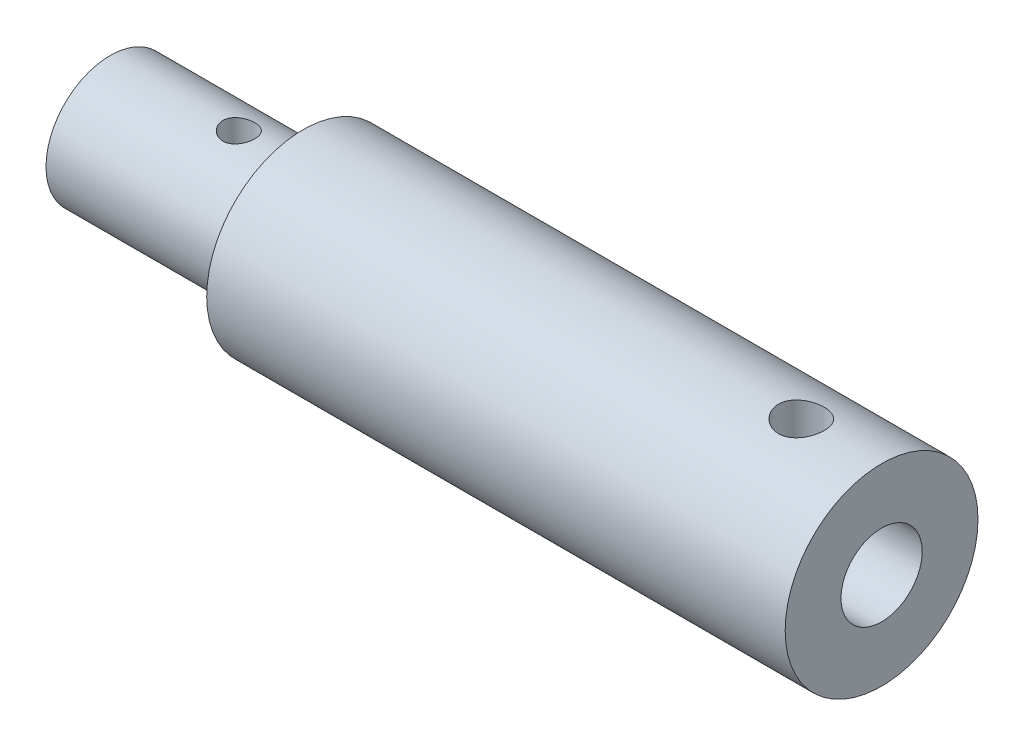
ISO-10303-21;
HEADER;
FILE_DESCRIPTION(('STEP AP214'),'2;1');
FILE_NAME('part.step','',(''),(''),'','','');
FILE_SCHEMA(('AUTOMOTIVE_DESIGN { 1 0 10303 214 1 1 1 1 }'));
ENDSEC;
DATA;
#1=APPLICATION_CONTEXT('core data for automotive mechanical design processes');
#2=APPLICATION_PROTOCOL_DEFINITION('international standard','automotive_design',2000,#1);
#3=PRODUCT_CONTEXT('',#1,'mechanical');
#4=PRODUCT('Part','Part','',(#3));
#5=PRODUCT_RELATED_PRODUCT_CATEGORY('part','',(#4));
#6=PRODUCT_DEFINITION_FORMATION('','',#4);
#7=PRODUCT_DEFINITION_CONTEXT('part definition',#1,'design');
#8=PRODUCT_DEFINITION('design','',#6,#7);
#9=PRODUCT_DEFINITION_SHAPE('','',#8);
#10=(LENGTH_UNIT() NAMED_UNIT(*) SI_UNIT(.MILLI.,.METRE.));
#11=(NAMED_UNIT(*) PLANE_ANGLE_UNIT() SI_UNIT($,.RADIAN.));
#12=(NAMED_UNIT(*) SI_UNIT($,.STERADIAN.) SOLID_ANGLE_UNIT());
#13=UNCERTAINTY_MEASURE_WITH_UNIT(LENGTH_MEASURE(1.E-05),#10,'distance_accuracy_value','');
#14=(GEOMETRIC_REPRESENTATION_CONTEXT(3) GLOBAL_UNCERTAINTY_ASSIGNED_CONTEXT((#13)) GLOBAL_UNIT_ASSIGNED_CONTEXT((#10,
#11,#12)) REPRESENTATION_CONTEXT('',''));
#15=CARTESIAN_POINT('',(0.,0.,0.));
#16=DIRECTION('',(0.,0.,1.));
#17=DIRECTION('',(1.,0.,0.));
#18=AXIS2_PLACEMENT_3D('',#15,#16,#17);
#19=CARTESIAN_POINT('',(38.1,0.,0.));
#20=DIRECTION('',(-1.,0.,0.));
#21=DIRECTION('',(0.,0.,1.));
#22=AXIS2_PLACEMENT_3D('',#19,#20,#21);
#23=CYLINDRICAL_SURFACE('',#22,4.7625);
#24=CARTESIAN_POINT('',(34.1376,4.62642714845916,-1.1303));
#25=CARTESIAN_POINT('',(34.0750775259716,4.62642838901824,-1.13029805423627));
#26=CARTESIAN_POINT('',(34.0125327757224,4.62770838699482,-1.12509469807993));
#27=CARTESIAN_POINT('',(33.889232022083,4.6326785638604,-1.10444752292998));
#28=CARTESIAN_POINT('',(33.8284771909426,4.63637028710392,-1.08899714213105));
#29=CARTESIAN_POINT('',(33.7105575827576,4.64572278948456,-1.04837814678197));
#30=CARTESIAN_POINT('',(33.6533885619544,4.65138118712488,-1.02322128202526));
#31=CARTESIAN_POINT('',(33.5440782330937,4.66402656033619,-0.96393837411517));
#32=CARTESIAN_POINT('',(33.4919370072882,4.67101355763679,-0.92981218426262));
#33=CARTESIAN_POINT('',(33.3931270444802,4.68568402813969,-0.852836301919557));
#34=CARTESIAN_POINT('',(33.3465727707916,4.69337771733691,-0.80984159842551));
#35=CARTESIAN_POINT('',(33.2612641255741,4.70850573012954,-0.716661805014784));
#36=CARTESIAN_POINT('',(33.2225104296223,4.71594003121431,-0.666476092957028));
#37=CARTESIAN_POINT('',(33.1534411997972,4.72982392662853,-0.559561665599791));
#38=CARTESIAN_POINT('',(33.1232371319024,4.7362600587655,-0.502759041559995));
#39=CARTESIAN_POINT('',(33.0728477682259,4.74730637166582,-0.384705189759932));
#40=CARTESIAN_POINT('',(33.052661144161,4.75191679449644,-0.323454553028317));
#41=CARTESIAN_POINT('',(33.0232435558391,4.75872001042334,-0.199435431201459));
#42=CARTESIAN_POINT('',(33.0138184738088,4.76095558789368,-0.136715378385379));
#43=CARTESIAN_POINT('',(33.0055831971712,4.76290595779978,-0.0105471731538529));
#44=CARTESIAN_POINT('',(33.0067715822857,4.7626210875181,0.0529008807067487));
#45=CARTESIAN_POINT('',(33.0195878043426,4.75959486535025,0.177381143927695));
#46=CARTESIAN_POINT('',(33.0310062398402,4.75690278929689,0.238436289350237));
#47=CARTESIAN_POINT('',(33.0636230697014,4.74942148334886,0.357738034135677));
#48=CARTESIAN_POINT('',(33.084821954153,4.74463214836336,0.415984492596646));
#49=CARTESIAN_POINT('',(33.136573912979,4.73341744305927,0.528579543133831));
#50=CARTESIAN_POINT('',(33.1672035332136,4.72697876022154,0.582891572165086));
#51=CARTESIAN_POINT('',(33.2368898743976,4.7131670289965,0.685679466576254));
#52=CARTESIAN_POINT('',(33.2759479300973,4.70579383269348,0.734154405681964));
#53=CARTESIAN_POINT('',(33.3625124952201,4.69070701664461,0.825139727879791));
#54=CARTESIAN_POINT('',(33.4102021517143,4.68298948105039,0.867475386599055));
#55=CARTESIAN_POINT('',(33.512084880592,4.66825033727962,0.94358476200142));
#56=CARTESIAN_POINT('',(33.5662781985238,4.66122875539735,0.977358155263043));
#57=CARTESIAN_POINT('',(33.6799470965797,4.64866391717303,1.03548149898305));
#58=CARTESIAN_POINT('',(33.7394429361595,4.64312668568723,1.05979322029418));
#59=CARTESIAN_POINT('',(33.8618394839337,4.6342370321862,1.09801758146264));
#60=CARTESIAN_POINT('',(33.9247395417684,4.63088419443757,1.11193220016862));
#61=CARTESIAN_POINT('',(34.0505486305075,4.62682920681551,1.12868548039284));
#62=CARTESIAN_POINT('',(34.1134215409437,4.6260656397816,1.13178082925175));
#63=CARTESIAN_POINT('',(34.2387852257098,4.62710909642491,1.12750718204534));
#64=CARTESIAN_POINT('',(34.3012760309748,4.62891590916261,1.12013904467148));
#65=CARTESIAN_POINT('',(34.4231736827724,4.6348380433821,1.09537169422541));
#66=CARTESIAN_POINT('',(34.4826119865441,4.63891973604529,1.07811850697576));
#67=CARTESIAN_POINT('',(34.5977535080337,4.64890046664806,1.0342311057962));
#68=CARTESIAN_POINT('',(34.6534563170258,4.6547997030637,1.00759586729929));
#69=CARTESIAN_POINT('',(34.7606430296264,4.66788249324334,0.945151389946627));
#70=CARTESIAN_POINT('',(34.8120337592089,4.67508711291606,0.909186724966108));
#71=CARTESIAN_POINT('',(34.9081449640821,4.68991561801779,0.829303668896757));
#72=CARTESIAN_POINT('',(34.9528644544695,4.69753956512693,0.785384105507542));
#73=CARTESIAN_POINT('',(35.0353852160885,4.71255346581324,0.689666770395239));
#74=CARTESIAN_POINT('',(35.0730099797708,4.71993441049171,0.637715160229859));
#75=CARTESIAN_POINT('',(35.138999685825,4.73345357065448,0.528080996625005));
#76=CARTESIAN_POINT('',(35.1673650949585,4.73959184877535,0.470398732257505));
#77=CARTESIAN_POINT('',(35.2137977943514,4.74989666973638,0.351326818689582));
#78=CARTESIAN_POINT('',(35.2319360521981,4.75407676549875,0.289966071089918));
#79=CARTESIAN_POINT('',(35.2576166732252,4.76005328584338,0.164956304659748));
#80=CARTESIAN_POINT('',(35.2651608670675,4.76185012225163,0.101307683125544));
#81=CARTESIAN_POINT('',(35.2693448257628,4.76284277619185,-0.0248058123466566));
#82=CARTESIAN_POINT('',(35.2662463021068,4.76210102100744,-0.0872616512535958));
#83=CARTESIAN_POINT('',(35.2498263168143,4.75823630150041,-0.210735438966009));
#84=CARTESIAN_POINT('',(35.2365051060361,4.75511339560976,-0.271753423017671));
#85=CARTESIAN_POINT('',(35.200152265988,4.74684485428859,-0.390375307573605));
#86=CARTESIAN_POINT('',(35.1771637211855,4.74170820034098,-0.44799307821931));
#87=CARTESIAN_POINT('',(35.1221687352297,4.72995611183917,-0.558585363410868));
#88=CARTESIAN_POINT('',(35.0901612606168,4.72334050783327,-0.611559344922467));
#89=CARTESIAN_POINT('',(35.0172156117081,4.70916627810365,-0.712616660322824));
#90=CARTESIAN_POINT('',(34.9760970787535,4.70159016205745,-0.760567360093438));
#91=CARTESIAN_POINT('',(34.8864524871105,4.68643366014744,-0.848977207813521));
#92=CARTESIAN_POINT('',(34.837924596891,4.67885327369088,-0.88943449796752));
#93=CARTESIAN_POINT('',(34.7338828135499,4.66440648065221,-0.96235454223778));
#94=CARTESIAN_POINT('',(34.6782675833458,4.65755378982527,-0.99467561772967));
#95=CARTESIAN_POINT('',(34.562240168282,4.64551729998629,-1.04946070676233));
#96=CARTESIAN_POINT('',(34.5018317610909,4.64033220265826,-1.07193239358025));
#97=CARTESIAN_POINT('',(34.3908121579242,4.63309160945185,-1.10275167928248));
#98=CARTESIAN_POINT('',(34.3407641625617,4.63061028274686,-1.11306095578954));
#99=CARTESIAN_POINT('',(34.2396823499598,4.62727760135537,-1.12683567723709));
#100=CARTESIAN_POINT('',(34.1886486001582,4.62642613556252,-1.13030158868497));
#101=CARTESIAN_POINT('',(34.1376,4.62642714845916,-1.1303));
#102=B_SPLINE_CURVE_WITH_KNOTS('',3,(#24,#25,#26,#27,#28,#29,#30,#31,#32,#33,#34,#35,#36,#37,
#38,#39,#40,#41,#42,#43,#44,#45,#46,#47,#48,#49,#50,#51,#52,#53,#54,#55,#56,#57,#58,#59,#60,#61,
#62,#63,#64,#65,#66,#67,#68,#69,#70,#71,#72,#73,#74,#75,#76,#77,#78,#79,#80,#81,#82,#83,#84,#85,
#86,#87,#88,#89,#90,#91,#92,#93,#94,#95,#96,#97,#98,#99,#100,#101),.UNSPECIFIED.,.T.,.F.,(4,2,2,
2,2,2,2,2,2,2,2,2,2,2,2,2,2,2,2,2,2,2,2,2,2,2,2,2,2,2,2,2,2,2,2,2,2,2,4),(0.,0.187380121042666,
0.374880349201824,0.562154315010259,0.749431343997326,0.940055506735482,1.13069617158294,
1.32371850082295,1.51671522902965,1.70617275891672,1.89560493626407,2.08124599438499,
2.26689635579561,2.45409517358991,2.64132365848947,2.83312791507994,3.02493941559165,
3.21751806320303,3.41006004856844,3.59800175755483,3.78592804389812,3.97114726568215,
4.15638672060751,4.34493623230582,4.53351355287892,4.72629599338789,4.91906871428536,
5.11048675596524,5.30187171639601,5.48858443275623,5.6752925674496,5.86117727273005,
6.0470832868009,6.2370637896613,6.42709133036918,6.62022893778867,6.81321581056895,
6.96621911322517,7.11921198539391),.UNSPECIFIED.);
#103=CARTESIAN_POINT('',(34.1376,4.62642714845916,-1.1303));
#104=VERTEX_POINT('',#103);
#105=EDGE_CURVE('E60',#104,#104,#102,.T.);
#106=ORIENTED_EDGE('',*,*,#105,.F.);
#107=EDGE_LOOP('',(#106));
#108=FACE_BOUND('',#107,.T.);
#109=CARTESIAN_POINT('',(38.1,0.,0.));
#110=DIRECTION('',(1.,0.,0.));
#111=DIRECTION('',(0.,0.,-1.));
#112=AXIS2_PLACEMENT_3D('',#109,#110,#111);
#113=CIRCLE('',#112,4.7625);
#114=CARTESIAN_POINT('',(38.1,0.,-4.7625));
#115=VERTEX_POINT('',#114);
#116=EDGE_CURVE('E10',#115,#115,#113,.T.);
#117=ORIENTED_EDGE('',*,*,#116,.F.);
#118=EDGE_LOOP('',(#117));
#119=FACE_BOUND('',#118,.T.);
#120=CARTESIAN_POINT('',(9.525,0.,0.));
#121=DIRECTION('',(-1.,0.,0.));
#122=DIRECTION('',(0.,0.,1.));
#123=AXIS2_PLACEMENT_3D('',#120,#121,#122);
#124=CIRCLE('',#123,4.7625);
#125=CARTESIAN_POINT('',(9.525,0.,4.7625));
#126=VERTEX_POINT('',#125);
#127=EDGE_CURVE('E61',#126,#126,#124,.T.);
#128=ORIENTED_EDGE('',*,*,#127,.F.);
#129=EDGE_LOOP('',(#128));
#130=FACE_BOUND('',#129,.T.);
#131=ADVANCED_FACE('F32',(#108,#119,#130),#23,.T.);
#132=CARTESIAN_POINT('',(30.1752,0.,0.));
#133=DIRECTION('',(1.,0.,0.));
#134=DIRECTION('',(0.,0.,-1.));
#135=AXIS2_PLACEMENT_3D('',#132,#133,#134);
#136=CYLINDRICAL_SURFACE('',#135,2.0066);
#137=CARTESIAN_POINT('',(38.1,0.,0.));
#138=DIRECTION('',(1.,0.,0.));
#139=DIRECTION('',(0.,0.,-1.));
#140=AXIS2_PLACEMENT_3D('',#137,#138,#139);
#141=CIRCLE('',#140,2.0066);
#142=CARTESIAN_POINT('',(38.1,0.,-2.0066));
#143=VERTEX_POINT('',#142);
#144=EDGE_CURVE('E49',#143,#143,#141,.T.);
#145=ORIENTED_EDGE('',*,*,#144,.T.);
#146=EDGE_LOOP('',(#145));
#147=FACE_BOUND('',#146,.T.);
#148=CARTESIAN_POINT('',(30.1752,0.,0.));
#149=DIRECTION('',(1.,0.,0.));
#150=DIRECTION('',(0.,0.,-1.));
#151=AXIS2_PLACEMENT_3D('',#148,#149,#150);
#152=CIRCLE('',#151,2.0066);
#153=CARTESIAN_POINT('',(30.1752,0.,-2.0066));
#154=VERTEX_POINT('',#153);
#155=EDGE_CURVE('E44',#154,#154,#152,.T.);
#156=ORIENTED_EDGE('',*,*,#155,.F.);
#157=EDGE_LOOP('',(#156));
#158=FACE_BOUND('',#157,.T.);
#159=CARTESIAN_POINT('',(34.1376,1.65797028622349,-1.1303));
#160=CARTESIAN_POINT('',(34.195251209096,1.65797637198512,-1.13029575818968));
#161=CARTESIAN_POINT('',(34.2529460500531,1.6610253484613,-1.12585828294536));
#162=CARTESIAN_POINT('',(34.3664640189629,1.67273264944485,-1.10838248876552));
#163=CARTESIAN_POINT('',(34.4222840246714,1.68139988609383,-1.09533050419437));
#164=CARTESIAN_POINT('',(34.530177119279,1.70299732881238,-1.06143323018493));
#165=CARTESIAN_POINT('',(34.5822720396219,1.7158996982644,-1.04063871395273));
#166=CARTESIAN_POINT('',(34.6822106018923,1.744467628616,-0.992002970624394));
#167=CARTESIAN_POINT('',(34.7300532218785,1.76013385105757,-0.96416005576344));
#168=CARTESIAN_POINT('',(34.8257287413124,1.79448726439518,-0.898756055590558));
#169=CARTESIAN_POINT('',(34.873018621699,1.81331851857658,-0.8604760313723));
#170=CARTESIAN_POINT('',(34.960946743248,1.85072451409441,-0.776766436810111));
#171=CARTESIAN_POINT('',(35.001580781707,1.86929908662915,-0.731332384427762));
#172=CARTESIAN_POINT('',(35.078703338456,1.90611899100281,-0.629554883377022));
#173=CARTESIAN_POINT('',(35.1144739746953,1.92417921142352,-0.572593976802609));
#174=CARTESIAN_POINT('',(35.175670785692,1.95595793429568,-0.452252347783182));
#175=CARTESIAN_POINT('',(35.2011052285507,1.9696799050299,-0.388876807408993));
#176=CARTESIAN_POINT('',(35.2385841456561,1.99017791322298,-0.263298922756158));
#177=CARTESIAN_POINT('',(35.2515958143849,1.99745173094696,-0.20146849318662));
#178=CARTESIAN_POINT('',(35.2670970835921,2.00613694274782,-0.0761139088710537));
#179=CARTESIAN_POINT('',(35.2695951448153,2.0075530507558,-0.0125911574556196));
#180=CARTESIAN_POINT('',(35.264249179399,2.0045455488276,0.106850205033366));
#181=CARTESIAN_POINT('',(35.2575095057508,2.00074545106449,0.162838624304153));
#182=CARTESIAN_POINT('',(35.2359304080036,1.98874702230872,0.272734613055332));
#183=CARTESIAN_POINT('',(35.2210903561887,1.98054835046188,0.326642020926973));
#184=CARTESIAN_POINT('',(35.183764753,1.96037701770621,0.43156758944857));
#185=CARTESIAN_POINT('',(35.1612068992025,1.94836874781511,0.482552899430881));
#186=CARTESIAN_POINT('',(35.1092549550227,1.92158367402541,0.580105321753611));
#187=CARTESIAN_POINT('',(35.0798587746444,1.90680602399083,0.626671077208092));
#188=CARTESIAN_POINT('',(35.0113534431108,1.87384893860437,0.719601195939145));
#189=CARTESIAN_POINT('',(34.9715279027535,1.85547396405178,0.765368010966156));
#190=CARTESIAN_POINT('',(34.8851637262768,1.81829489840694,0.849932765249481));
#191=CARTESIAN_POINT('',(34.8386177300013,1.79949035611598,0.888722957819215));
#192=CARTESIAN_POINT('',(34.7348351650225,1.76153523627191,0.961921435377068));
#193=CARTESIAN_POINT('',(34.6770032870042,1.74252111781037,0.995564736747795));
#194=CARTESIAN_POINT('',(34.555279012948,1.7087784001161,1.05243571686152));
#195=CARTESIAN_POINT('',(34.4913937367897,1.69404484714625,1.07567545224779));
#196=CARTESIAN_POINT('',(34.3645675029055,1.67236518692917,1.10905776708861));
#197=CARTESIAN_POINT('',(34.3019578934537,1.66489153536032,1.12009738714326));
#198=CARTESIAN_POINT('',(34.1753645838291,1.6572034845318,1.13144850319233));
#199=CARTESIAN_POINT('',(34.1113827906175,1.65697959102847,1.13177403031368));
#200=CARTESIAN_POINT('',(33.9946236269409,1.66326124789685,1.12250636240805));
#201=CARTESIAN_POINT('',(33.9416555800528,1.66872233766816,1.11445273704982));
#202=CARTESIAN_POINT('',(33.8379846921949,1.6840438818777,1.09116121762532));
#203=CARTESIAN_POINT('',(33.7872829611183,1.69390646646436,1.07591984477232));
#204=CARTESIAN_POINT('',(33.6872040249903,1.7173395027059,1.03812264126762));
#205=CARTESIAN_POINT('',(33.6379599395371,1.73104195374579,1.01529973584392));
#206=CARTESIAN_POINT('',(33.5437052812119,1.76055942539692,0.963208300403958));
#207=CARTESIAN_POINT('',(33.4986967431823,1.77637545267181,0.933936694636104));
#208=CARTESIAN_POINT('',(33.40627152822,1.81151423791696,0.864078193507188));
#209=CARTESIAN_POINT('',(33.3597175367299,1.8309801706988,0.822416850455623));
#210=CARTESIAN_POINT('',(33.273896521323,1.86905581433525,0.731773600336805));
#211=CARTESIAN_POINT('',(33.2346343288531,1.88766495139167,0.682786878095547));
#212=CARTESIAN_POINT('',(33.1623500564127,1.92326046309013,0.57523996356544));
#213=CARTESIAN_POINT('',(33.1298273531428,1.94008823325962,0.516287380473032));
#214=CARTESIAN_POINT('',(33.0755065509982,1.9688512061512,0.392539738067625));
#215=CARTESIAN_POINT('',(33.0536969104736,1.9807916718561,0.32775105571676));
#216=CARTESIAN_POINT('',(33.0236957967992,1.99737580942607,0.201404578813098));
#217=CARTESIAN_POINT('',(33.0143251982543,2.0026485261898,0.140210094316744));
#218=CARTESIAN_POINT('',(33.0057409612112,2.00747497830063,0.0169004675144971));
#219=CARTESIAN_POINT('',(33.0065213636172,2.00703206897949,-0.0452141132610421));
#220=CARTESIAN_POINT('',(33.0176092222191,2.00080706438243,-0.162229491830126));
#221=CARTESIAN_POINT('',(33.0269931836723,1.99554256873961,-0.217249532446759));
#222=CARTESIAN_POINT('',(33.0535528496194,1.98088395688254,-0.324789512871052));
#223=CARTESIAN_POINT('',(33.0707294418231,1.97148937018629,-0.377309167089932));
#224=CARTESIAN_POINT('',(33.1128411583277,1.94901763234977,-0.480246548826341));
#225=CARTESIAN_POINT('',(33.1379994403406,1.93583574364216,-0.530549324639033));
#226=CARTESIAN_POINT('',(33.1950746214801,1.90699069543875,-0.626368651197412));
#227=CARTESIAN_POINT('',(33.2269940805527,1.89132659668533,-0.671883379275195));
#228=CARTESIAN_POINT('',(33.3009996521795,1.85676328904105,-0.76255918797544));
#229=CARTESIAN_POINT('',(33.3438417254275,1.83770057584232,-0.807041650274417));
#230=CARTESIAN_POINT('',(33.4362666220146,1.7997107194572,-0.888544773205655));
#231=CARTESIAN_POINT('',(33.485858101351,1.78078378376282,-0.925555697837137));
#232=CARTESIAN_POINT('',(33.5950385239224,1.74367470592001,-0.993812600678885));
#233=CARTESIAN_POINT('',(33.6551027141693,1.72566131401167,-1.02439779980572));
#234=CARTESIAN_POINT('',(33.7808025036503,1.694847031231,-1.07462502182381));
#235=CARTESIAN_POINT('',(33.8464201781428,1.68203008936981,-1.09430081239785));
#236=CARTESIAN_POINT('',(33.9503399786615,1.66811353993528,-1.11530910819667));
#237=CARTESIAN_POINT('',(33.9874624722939,1.66433594009497,-1.12091473749271));
#238=CARTESIAN_POINT('',(34.0622504686519,1.65926245642189,-1.12841137188855));
#239=CARTESIAN_POINT('',(34.099915913103,1.65796630822591,-1.13030277268684));
#240=CARTESIAN_POINT('',(34.1376,1.65797028622349,-1.1303));
#241=B_SPLINE_CURVE_WITH_KNOTS('',3,(#159,#160,#161,#162,#163,#164,#165,#166,#167,#168,#169,
#170,#171,#172,#173,#174,#175,#176,#177,#178,#179,#180,#181,#182,#183,#184,#185,#186,#187,#188,
#189,#190,#191,#192,#193,#194,#195,#196,#197,#198,#199,#200,#201,#202,#203,#204,#205,#206,#207,
#208,#209,#210,#211,#212,#213,#214,#215,#216,#217,#218,#219,#220,#221,#222,#223,#224,#225,#226,
#227,#228,#229,#230,#231,#232,#233,#234,#235,#236,#237,#238,#239,#240),.UNSPECIFIED.,.T.,.F.,(4,
2,2,2,2,2,2,2,2,2,2,2,2,2,2,2,2,2,2,2,2,2,2,2,2,2,2,2,2,2,2,2,2,2,2,2,2,2,2,2,4),(0.,
0.172793012733998,0.345860796795422,0.517813089371488,0.689806595564021,0.880106292646278,
1.07052569142837,1.27834162951453,1.48599100323516,1.67569558578719,1.86524747580936,
2.03400769409389,2.20278099182944,2.37318077999772,2.54363271599297,2.73302836796344,
2.92263303950349,3.13022789629359,3.33758154560347,3.52839104344624,3.71895064808977,
3.87977963433922,4.0406865399702,4.20800023838707,4.37539391165049,4.57086929359125,
4.76647373635161,4.9735204085456,5.18034352840844,5.36568597777933,5.55091962767822,
5.71833820331424,5.88577585548932,6.05838281740344,6.23105524970179,6.42415185315242,
6.6174984751499,6.82568958982216,7.03323264487312,7.14619195368787,7.25913922763363),.UNSPECIFIED.);
#242=CARTESIAN_POINT('',(34.1376,1.65797028622349,-1.1303));
#243=VERTEX_POINT('',#242);
#244=EDGE_CURVE('E53',#243,#243,#241,.T.);
#245=ORIENTED_EDGE('',*,*,#244,.F.);
#246=EDGE_LOOP('',(#245));
#247=FACE_BOUND('',#246,.T.);
#248=ADVANCED_FACE('F62',(#147,#158,#247),#136,.F.);
#249=CARTESIAN_POINT('',(38.1,0.,0.));
#250=DIRECTION('',(1.,0.,0.));
#251=DIRECTION('',(0.,0.,-1.));
#252=AXIS2_PLACEMENT_3D('',#249,#250,#251);
#253=PLANE('',#252);
#254=ORIENTED_EDGE('',*,*,#144,.F.);
#255=EDGE_LOOP('',(#254));
#256=FACE_BOUND('',#255,.T.);
#257=ORIENTED_EDGE('',*,*,#116,.T.);
#258=EDGE_LOOP('',(#257));
#259=FACE_BOUND('',#258,.T.);
#260=ADVANCED_FACE('F95',(#256,#259),#253,.T.);
#261=CARTESIAN_POINT('',(30.1752,0.,0.));
#262=DIRECTION('',(1.,0.,0.));
#263=DIRECTION('',(0.,0.,-1.));
#264=AXIS2_PLACEMENT_3D('',#261,#262,#263);
#265=PLANE('',#264);
#266=ORIENTED_EDGE('',*,*,#155,.T.);
#267=EDGE_LOOP('',(#266));
#268=FACE_BOUND('',#267,.T.);
#269=ADVANCED_FACE('F71',(#268),#265,.T.);
#270=CARTESIAN_POINT('',(34.1376,8.6868,0.));
#271=DIRECTION('',(0.,-1.,0.));
#272=DIRECTION('',(0.,0.,-1.));
#273=AXIS2_PLACEMENT_3D('',#270,#271,#272);
#274=CYLINDRICAL_SURFACE('',#273,1.1303);
#275=ORIENTED_EDGE('',*,*,#244,.T.);
#276=EDGE_LOOP('',(#275));
#277=FACE_BOUND('',#276,.T.);
#278=ORIENTED_EDGE('',*,*,#105,.T.);
#279=EDGE_LOOP('',(#278));
#280=FACE_BOUND('',#279,.T.);
#281=ADVANCED_FACE('F66',(#277,#280),#274,.F.);
#282=CARTESIAN_POINT('',(9.525,0.,0.));
#283=DIRECTION('',(-1.,0.,0.));
#284=DIRECTION('',(0.,0.,1.));
#285=AXIS2_PLACEMENT_3D('',#282,#283,#284);
#286=PLANE('',#285);
#287=CARTESIAN_POINT('',(9.525,0.,0.));
#288=DIRECTION('',(-1.,0.,0.));
#289=DIRECTION('',(0.,0.,1.));
#290=AXIS2_PLACEMENT_3D('',#287,#288,#289);
#291=CIRCLE('',#290,3.175);
#292=CARTESIAN_POINT('',(9.525,0.,3.175));
#293=VERTEX_POINT('',#292);
#294=EDGE_CURVE('E82',#293,#293,#291,.T.);
#295=ORIENTED_EDGE('',*,*,#294,.F.);
#296=EDGE_LOOP('',(#295));
#297=FACE_BOUND('',#296,.T.);
#298=ORIENTED_EDGE('',*,*,#127,.T.);
#299=EDGE_LOOP('',(#298));
#300=FACE_BOUND('',#299,.T.);
#301=ADVANCED_FACE('F70',(#297,#300),#286,.T.);
#302=CARTESIAN_POINT('',(9.525,0.,0.));
#303=DIRECTION('',(-1.,0.,0.));
#304=DIRECTION('',(0.,0.,1.));
#305=AXIS2_PLACEMENT_3D('',#302,#303,#304);
#306=CYLINDRICAL_SURFACE('',#305,3.175);
#307=CARTESIAN_POINT('',(6.35,-3.07581310225443,0.7874));
#308=CARTESIAN_POINT('',(6.3065075021694,-3.075813939192,0.787398744653916));
#309=CARTESIAN_POINT('',(6.26300103699984,-3.07674566145374,0.783784226445852));
#310=CARTESIAN_POINT('',(6.17723664816889,-3.0803625423924,0.769444212040904));
#311=CARTESIAN_POINT('',(6.13497947835965,-3.08304873806023,0.758714510319309));
#312=CARTESIAN_POINT('',(6.05296662188354,-3.08985205147743,0.730512083187864));
#313=CARTESIAN_POINT('',(6.01320781427514,-3.09396734028734,0.713047973268173));
#314=CARTESIAN_POINT('',(5.93718029137026,-3.10316287879354,0.671898613390606));
#315=CARTESIAN_POINT('',(5.9009117097853,-3.10824316543701,0.648213125219556));
#316=CARTESIAN_POINT('',(5.83210863740529,-3.11891943941669,0.594745480228861));
#317=CARTESIAN_POINT('',(5.79966087582295,-3.12452355873939,0.564853320914091));
#318=CARTESIAN_POINT('',(5.74018427843339,-3.13554546853052,0.500057836854159));
#319=CARTESIAN_POINT('',(5.71315594309829,-3.14096324175205,0.465154049806475));
#320=CARTESIAN_POINT('',(5.66493138615076,-3.15109190098523,0.390732789039579));
#321=CARTESIAN_POINT('',(5.64382024601062,-3.15579207165152,0.351158598507652));
#322=CARTESIAN_POINT('',(5.60858236631455,-3.16386323206305,0.268887241267554));
#323=CARTESIAN_POINT('',(5.5944546131789,-3.1672344146853,0.22619052880039));
#324=CARTESIAN_POINT('',(5.57386200190988,-3.17221027199584,0.139790139759614));
#325=CARTESIAN_POINT('',(5.56724989496921,-3.17384884607327,0.0961235443472484));
#326=CARTESIAN_POINT('',(5.56141418710287,-3.17529294846481,0.00827220844257288));
#327=CARTESIAN_POINT('',(5.56218951053071,-3.17509874364066,-0.0359124556806589));
#328=CARTESIAN_POINT('',(5.57100049547967,-3.17292445001065,-0.122524852571927));
#329=CARTESIAN_POINT('',(5.57887723188311,-3.1709834549647,-0.164969881520884));
#330=CARTESIAN_POINT('',(5.60141214765311,-3.16557912503432,-0.247915901823041));
#331=CARTESIAN_POINT('',(5.61607068475941,-3.16211570984276,-0.288416790498507));
#332=CARTESIAN_POINT('',(5.65188248465348,-3.15399567959344,-0.366745072334393));
#333=CARTESIAN_POINT('',(5.67309255235268,-3.14932868981507,-0.404545374544142));
#334=CARTESIAN_POINT('',(5.72136229878054,-3.13930813357491,-0.476106034644211));
#335=CARTESIAN_POINT('',(5.74842298068023,-3.13395444943371,-0.509865698165378));
#336=CARTESIAN_POINT('',(5.80847867569626,-3.12297597059372,-0.573334431368741));
#337=CARTESIAN_POINT('',(5.84161258434032,-3.11734775299395,-0.602911621812153));
#338=CARTESIAN_POINT('',(5.91242902507928,-3.10658526700961,-0.656118863638047));
#339=CARTESIAN_POINT('',(5.95011176276347,-3.10145102096949,-0.679748646071946));
#340=CARTESIAN_POINT('',(6.02921177009863,-3.09224573629719,-0.720472946534791));
#341=CARTESIAN_POINT('',(6.07064578145341,-3.08817981532904,-0.737536183225514));
#342=CARTESIAN_POINT('',(6.15591937179795,-3.08163748493669,-0.764414044408799));
#343=CARTESIAN_POINT('',(6.19975844322203,-3.07916074152135,-0.774230192058727));
#344=CARTESIAN_POINT('',(6.2873759080488,-3.07614716365072,-0.786117397865361));
#345=CARTESIAN_POINT('',(6.33112622746548,-3.07556155245551,-0.788383246102544));
#346=CARTESIAN_POINT('',(6.41837987623272,-3.07626385331309,-0.78563841377291));
#347=CARTESIAN_POINT('',(6.46188322756007,-3.07755159595384,-0.780628391181266));
#348=CARTESIAN_POINT('',(6.54668781628929,-3.08180881345485,-0.763644712630663));
#349=CARTESIAN_POINT('',(6.58801318363588,-3.08475098063085,-0.751784048072299));
#350=CARTESIAN_POINT('',(6.66808920748939,-3.09195969992218,-0.721560843905088));
#351=CARTESIAN_POINT('',(6.70683956212605,-3.09622640698274,-0.703197543579798));
#352=CARTESIAN_POINT('',(6.78149211019935,-3.10570645375419,-0.660081187835403));
#353=CARTESIAN_POINT('',(6.81732473409086,-3.11093650401891,-0.63521143340858));
#354=CARTESIAN_POINT('',(6.88437965259862,-3.12171274313181,-0.579936031663543));
#355=CARTESIAN_POINT('',(6.9156012007029,-3.12725898296863,-0.549529489740265));
#356=CARTESIAN_POINT('',(6.97333452429436,-3.13820768442019,-0.48315051811217));
#357=CARTESIAN_POINT('',(6.99971167896369,-3.14360326164024,-0.447059655482855));
#358=CARTESIAN_POINT('',(7.04603077035707,-3.15350144612221,-0.370847613185458));
#359=CARTESIAN_POINT('',(7.0659730412783,-3.15800409975364,-0.330726642963904));
#360=CARTESIAN_POINT('',(7.09868451574826,-3.16558085850935,-0.247869409728026));
#361=CARTESIAN_POINT('',(7.11150500137962,-3.16866514841085,-0.205154367753034));
#362=CARTESIAN_POINT('',(7.12976342277996,-3.17310221692133,-0.118089634527151));
#363=CARTESIAN_POINT('',(7.1352027590944,-3.17445532401298,-0.0737402550265616));
#364=CARTESIAN_POINT('',(7.13846675001191,-3.17526440669889,0.014068680224866));
#365=CARTESIAN_POINT('',(7.13649022295012,-3.17476991760286,0.0575205020657558));
#366=CARTESIAN_POINT('',(7.12543325870032,-3.17204896452848,0.143452325637751));
#367=CARTESIAN_POINT('',(7.11635302665849,-3.16982255056599,0.185932355396543));
#368=CARTESIAN_POINT('',(7.0914523243211,-3.16389530862677,0.268510280526712));
#369=CARTESIAN_POINT('',(7.0756672884411,-3.16020223840382,0.308619453963481));
#370=CARTESIAN_POINT('',(7.03783730635837,-3.15173092032296,0.385642600762486));
#371=CARTESIAN_POINT('',(7.01579158215568,-3.14695253761078,0.422556176271458));
#372=CARTESIAN_POINT('',(6.96545682571119,-3.13668511744754,0.493084900281431));
#373=CARTESIAN_POINT('',(6.9370325551554,-3.13118195361417,0.52660147706722));
#374=CARTESIAN_POINT('',(6.87501083497311,-3.12014954155491,0.588456610505146));
#375=CARTESIAN_POINT('',(6.8414120809635,-3.11462028709371,0.616793857602898));
#376=CARTESIAN_POINT('',(6.76925578960345,-3.10404681922997,0.667993949997186));
#377=CARTESIAN_POINT('',(6.73061883096044,-3.09901332040042,0.690747250541119));
#378=CARTESIAN_POINT('',(6.64994904181384,-3.09014474773968,0.729401479098359));
#379=CARTESIAN_POINT('',(6.60791873737093,-3.08630879260421,0.745307449526481));
#380=CARTESIAN_POINT('',(6.52996143803863,-3.08087672885657,0.767414999781062));
#381=CARTESIAN_POINT('',(6.49441121132723,-3.07899203964911,0.774893177484593));
#382=CARTESIAN_POINT('',(6.42257719135974,-3.07645992809139,0.784885996993761));
#383=CARTESIAN_POINT('',(6.386293458763,-3.07581240384986,0.787401047556557));
#384=CARTESIAN_POINT('',(6.35,-3.07581310225443,0.7874));
#385=B_SPLINE_CURVE_WITH_KNOTS('',3,(#307,#308,#309,#310,#311,#312,#313,#314,#315,#316,#317,
#318,#319,#320,#321,#322,#323,#324,#325,#326,#327,#328,#329,#330,#331,#332,#333,#334,#335,#336,
#337,#338,#339,#340,#341,#342,#343,#344,#345,#346,#347,#348,#349,#350,#351,#352,#353,#354,#355,
#356,#357,#358,#359,#360,#361,#362,#363,#364,#365,#366,#367,#368,#369,#370,#371,#372,#373,#374,
#375,#376,#377,#378,#379,#380,#381,#382,#383,#384),.UNSPECIFIED.,.T.,.F.,(4,2,2,2,2,2,2,2,2,2,2,
2,2,2,2,2,2,2,2,2,2,2,2,2,2,2,2,2,2,2,2,2,2,2,2,2,2,2,4),(0.,0.130344231751651,
0.260765573961923,0.391020615621169,0.521280645401966,0.654083865117333,0.786899343275963,
0.92153658714875,1.05615428381907,1.18808641559695,1.31999933769578,1.44903147118194,
1.57807041188434,1.70826117252595,1.8384742739541,1.97215653148636,2.10584483319728,
2.24016233276009,2.37445159409166,2.50524834212076,2.63603326260977,2.76472028769879,
2.89342237232645,3.02461332123561,3.15582548612889,3.29026266290113,3.42469285652325,
3.55814207277701,3.69156596399904,3.82143865850466,3.9513076025865,4.08049857472727,
4.20970560813494,4.34196626996363,4.47426032677967,4.6089727912647,4.74358588227683,
4.85236401401124,4.96113318653611),.UNSPECIFIED.);
#386=CARTESIAN_POINT('',(6.35,-3.07581310225443,0.7874));
#387=VERTEX_POINT('',#386);
#388=EDGE_CURVE('E36',#387,#387,#385,.T.);
#389=ORIENTED_EDGE('',*,*,#388,.F.);
#390=EDGE_LOOP('',(#389));
#391=FACE_BOUND('',#390,.T.);
#392=CARTESIAN_POINT('',(6.35,3.07581310225443,0.7874));
#393=CARTESIAN_POINT('',(6.39349249783059,3.075813939192,0.787398744653916));
#394=CARTESIAN_POINT('',(6.43699896300016,3.07674566145374,0.783784226445852));
#395=CARTESIAN_POINT('',(6.52276335183111,3.0803625423924,0.769444212040904));
#396=CARTESIAN_POINT('',(6.56502052164035,3.08304873806023,0.758714510319309));
#397=CARTESIAN_POINT('',(6.64703337811646,3.08985205147743,0.730512083187864));
#398=CARTESIAN_POINT('',(6.68679218572486,3.09396734028734,0.713047973268173));
#399=CARTESIAN_POINT('',(6.76281970862974,3.10316287879354,0.671898613390606));
#400=CARTESIAN_POINT('',(6.7990882902147,3.10824316543701,0.648213125219556));
#401=CARTESIAN_POINT('',(6.86789136259471,3.11891943941669,0.594745480228861));
#402=CARTESIAN_POINT('',(6.90033912417704,3.12452355873939,0.564853320914091));
#403=CARTESIAN_POINT('',(6.9598157215666,3.13554546853051,0.50005783685416));
#404=CARTESIAN_POINT('',(6.9868440569017,3.14096324175205,0.465154049806476));
#405=CARTESIAN_POINT('',(7.03506861384923,3.15109190098523,0.390732789039581));
#406=CARTESIAN_POINT('',(7.05617975398938,3.15579207165152,0.351158598507653));
#407=CARTESIAN_POINT('',(7.09141763368545,3.16386323206305,0.268887241267555));
#408=CARTESIAN_POINT('',(7.1055453868211,3.1672344146853,0.22619052880039));
#409=CARTESIAN_POINT('',(7.12613799809012,3.17221027199584,0.139790139759614));
#410=CARTESIAN_POINT('',(7.13275010503079,3.17384884607327,0.0961235443472485));
#411=CARTESIAN_POINT('',(7.13858581289713,3.17529294846481,0.00827220844257282));
#412=CARTESIAN_POINT('',(7.13781048946929,3.17509874364066,-0.035912455680659));
#413=CARTESIAN_POINT('',(7.12899950452032,3.17292445001065,-0.122524852571927));
#414=CARTESIAN_POINT('',(7.12112276811689,3.1709834549647,-0.164969881520884));
#415=CARTESIAN_POINT('',(7.09858785234688,3.16557912503432,-0.247915901823041));
#416=CARTESIAN_POINT('',(7.08392931524059,3.16211570984276,-0.288416790498508));
#417=CARTESIAN_POINT('',(7.04811751534651,3.15399567959344,-0.366745072334393));
#418=CARTESIAN_POINT('',(7.02690744764732,3.14932868981507,-0.404545374544142));
#419=CARTESIAN_POINT('',(6.97863770121946,3.13930813357491,-0.476106034644212));
#420=CARTESIAN_POINT('',(6.95157701931977,3.13395444943371,-0.509865698165379));
#421=CARTESIAN_POINT('',(6.89152132430373,3.12297597059372,-0.573334431368741));
#422=CARTESIAN_POINT('',(6.85838741565968,3.11734775299395,-0.602911621812153));
#423=CARTESIAN_POINT('',(6.78757097492071,3.10658526700961,-0.656118863638046));
#424=CARTESIAN_POINT('',(6.74988823723653,3.10145102096949,-0.679748646071947));
#425=CARTESIAN_POINT('',(6.67078822990136,3.09224573629719,-0.720472946534792));
#426=CARTESIAN_POINT('',(6.62935421854659,3.08817981532904,-0.737536183225514));
#427=CARTESIAN_POINT('',(6.54408062820204,3.08163748493669,-0.7644140444088));
#428=CARTESIAN_POINT('',(6.50024155677796,3.07916074152135,-0.774230192058727));
#429=CARTESIAN_POINT('',(6.41262409195119,3.07614716365072,-0.786117397865362));
#430=CARTESIAN_POINT('',(6.36887377253452,3.07556155245551,-0.788383246102544));
#431=CARTESIAN_POINT('',(6.28162012376728,3.07626385331309,-0.78563841377291));
#432=CARTESIAN_POINT('',(6.23811677243993,3.07755159595384,-0.780628391181266));
#433=CARTESIAN_POINT('',(6.1533121837107,3.08180881345485,-0.763644712630663));
#434=CARTESIAN_POINT('',(6.11198681636412,3.08475098063085,-0.751784048072299));
#435=CARTESIAN_POINT('',(6.03191079251061,3.09195969992218,-0.721560843905087));
#436=CARTESIAN_POINT('',(5.99316043787395,3.09622640698274,-0.703197543579798));
#437=CARTESIAN_POINT('',(5.91850788980064,3.10570645375419,-0.660081187835403));
#438=CARTESIAN_POINT('',(5.88267526590914,3.11093650401891,-0.63521143340858));
#439=CARTESIAN_POINT('',(5.81562034740137,3.12171274313181,-0.579936031663543));
#440=CARTESIAN_POINT('',(5.7843987992971,3.12725898296863,-0.549529489740265));
#441=CARTESIAN_POINT('',(5.72666547570564,3.13820768442019,-0.48315051811217));
#442=CARTESIAN_POINT('',(5.70028832103631,3.14360326164024,-0.447059655482855));
#443=CARTESIAN_POINT('',(5.65396922964293,3.15350144612221,-0.370847613185458));
#444=CARTESIAN_POINT('',(5.6340269587217,3.15800409975364,-0.330726642963904));
#445=CARTESIAN_POINT('',(5.60131548425174,3.16558085850935,-0.247869409728026));
#446=CARTESIAN_POINT('',(5.58849499862038,3.16866514841085,-0.205154367753034));
#447=CARTESIAN_POINT('',(5.57023657722004,3.17310221692133,-0.118089634527151));
#448=CARTESIAN_POINT('',(5.5647972409056,3.17445532401298,-0.0737402550265616));
#449=CARTESIAN_POINT('',(5.56153324998809,3.17526440669889,0.0140686802248663));
#450=CARTESIAN_POINT('',(5.56350977704988,3.17476991760286,0.0575205020657562));
#451=CARTESIAN_POINT('',(5.57456674129968,3.17204896452848,0.143452325637751));
#452=CARTESIAN_POINT('',(5.58364697334151,3.16982255056599,0.185932355396543));
#453=CARTESIAN_POINT('',(5.6085476756789,3.16389530862677,0.268510280526712));
#454=CARTESIAN_POINT('',(5.6243327115589,3.16020223840382,0.308619453963481));
#455=CARTESIAN_POINT('',(5.66216269364163,3.15173092032296,0.385642600762486));
#456=CARTESIAN_POINT('',(5.68420841784432,3.14695253761078,0.422556176271458));
#457=CARTESIAN_POINT('',(5.73454317428881,3.13668511744754,0.493084900281432));
#458=CARTESIAN_POINT('',(5.7629674448446,3.13118195361417,0.526601477067221));
#459=CARTESIAN_POINT('',(5.82498916502689,3.12014954155491,0.588456610505147));
#460=CARTESIAN_POINT('',(5.8585879190365,3.11462028709371,0.616793857602899));
#461=CARTESIAN_POINT('',(5.93074421039654,3.10404681922997,0.667993949997186));
#462=CARTESIAN_POINT('',(5.96938116903956,3.09901332040041,0.69074725054112));
#463=CARTESIAN_POINT('',(6.05005095818616,3.09014474773968,0.729401479098359));
#464=CARTESIAN_POINT('',(6.09208126262906,3.08630879260421,0.745307449526481));
#465=CARTESIAN_POINT('',(6.17003856196137,3.08087672885657,0.767414999781062));
#466=CARTESIAN_POINT('',(6.20558878867277,3.07899203964911,0.774893177484593));
#467=CARTESIAN_POINT('',(6.27742280864025,3.07645992809139,0.784885996993761));
#468=CARTESIAN_POINT('',(6.313706541237,3.07581240384986,0.787401047556557));
#469=CARTESIAN_POINT('',(6.35,3.07581310225443,0.7874));
#470=B_SPLINE_CURVE_WITH_KNOTS('',3,(#392,#393,#394,#395,#396,#397,#398,#399,#400,#401,#402,
#403,#404,#405,#406,#407,#408,#409,#410,#411,#412,#413,#414,#415,#416,#417,#418,#419,#420,#421,
#422,#423,#424,#425,#426,#427,#428,#429,#430,#431,#432,#433,#434,#435,#436,#437,#438,#439,#440,
#441,#442,#443,#444,#445,#446,#447,#448,#449,#450,#451,#452,#453,#454,#455,#456,#457,#458,#459,
#460,#461,#462,#463,#464,#465,#466,#467,#468,#469),.UNSPECIFIED.,.T.,.F.,(4,2,2,2,2,2,2,2,2,2,2,
2,2,2,2,2,2,2,2,2,2,2,2,2,2,2,2,2,2,2,2,2,2,2,2,2,2,2,4),(0.,0.130344231751651,
0.260765573961923,0.391020615621169,0.521280645401966,0.654083865117332,0.786899343275962,
0.921536587148749,1.05615428381907,1.18808641559695,1.31999933769578,1.44903147118194,
1.57807041188435,1.70826117252595,1.8384742739541,1.97215653148636,2.10584483319728,
2.24016233276009,2.37445159409166,2.50524834212076,2.63603326260977,2.76472028769879,
2.89342237232645,3.02461332123561,3.15582548612889,3.29026266290113,3.42469285652325,
3.55814207277701,3.69156596399904,3.82143865850466,3.9513076025865,4.08049857472727,
4.20970560813494,4.34196626996364,4.47426032677967,4.6089727912647,4.74358588227683,
4.85236401401125,4.96113318653611),.UNSPECIFIED.);
#471=CARTESIAN_POINT('',(6.35,3.07581310225443,0.7874));
#472=VERTEX_POINT('',#471);
#473=EDGE_CURVE('E180',#472,#472,#470,.T.);
#474=ORIENTED_EDGE('',*,*,#473,.F.);
#475=EDGE_LOOP('',(#474));
#476=FACE_BOUND('',#475,.T.);
#477=ORIENTED_EDGE('',*,*,#294,.T.);
#478=EDGE_LOOP('',(#477));
#479=FACE_BOUND('',#478,.T.);
#480=CARTESIAN_POINT('',(0.,0.,0.));
#481=DIRECTION('',(-1.,0.,0.));
#482=DIRECTION('',(0.,0.,1.));
#483=AXIS2_PLACEMENT_3D('',#480,#481,#482);
#484=CIRCLE('',#483,3.175);
#485=CARTESIAN_POINT('',(0.,0.,3.175));
#486=VERTEX_POINT('',#485);
#487=EDGE_CURVE('E79',#486,#486,#484,.T.);
#488=ORIENTED_EDGE('',*,*,#487,.F.);
#489=EDGE_LOOP('',(#488));
#490=FACE_BOUND('',#489,.T.);
#491=ADVANCED_FACE('F126',(#391,#476,#479,#490),#306,.T.);
#492=CARTESIAN_POINT('',(0.,0.,0.));
#493=DIRECTION('',(1.,0.,0.));
#494=DIRECTION('',(0.,0.,-1.));
#495=AXIS2_PLACEMENT_3D('',#492,#493,#494);
#496=PLANE('',#495);
#497=ORIENTED_EDGE('',*,*,#487,.T.);
#498=EDGE_LOOP('',(#497));
#499=FACE_BOUND('',#498,.T.);
#500=ADVANCED_FACE('F134',(#499),#496,.F.);
#501=CARTESIAN_POINT('',(6.35,-4.7625,0.));
#502=DIRECTION('',(0.,1.,0.));
#503=DIRECTION('',(0.,0.,1.));
#504=AXIS2_PLACEMENT_3D('',#501,#502,#503);
#505=CYLINDRICAL_SURFACE('',#504,0.7874);
#506=ORIENTED_EDGE('',*,*,#388,.T.);
#507=EDGE_LOOP('',(#506));
#508=FACE_BOUND('',#507,.T.);
#509=ORIENTED_EDGE('',*,*,#473,.T.);
#510=EDGE_LOOP('',(#509));
#511=FACE_BOUND('',#510,.T.);
#512=ADVANCED_FACE('F141',(#508,#511),#505,.F.);
#513=CLOSED_SHELL('',(#131,#248,#260,#269,#281,#301,#491,#500,#512));
#514=MANIFOLD_SOLID_BREP('B2',#513);
#515=ADVANCED_BREP_SHAPE_REPRESENTATION('',(#18,#514),#14);
#516=SHAPE_DEFINITION_REPRESENTATION(#9,#515);
ENDSEC;
END-ISO-10303-21;
